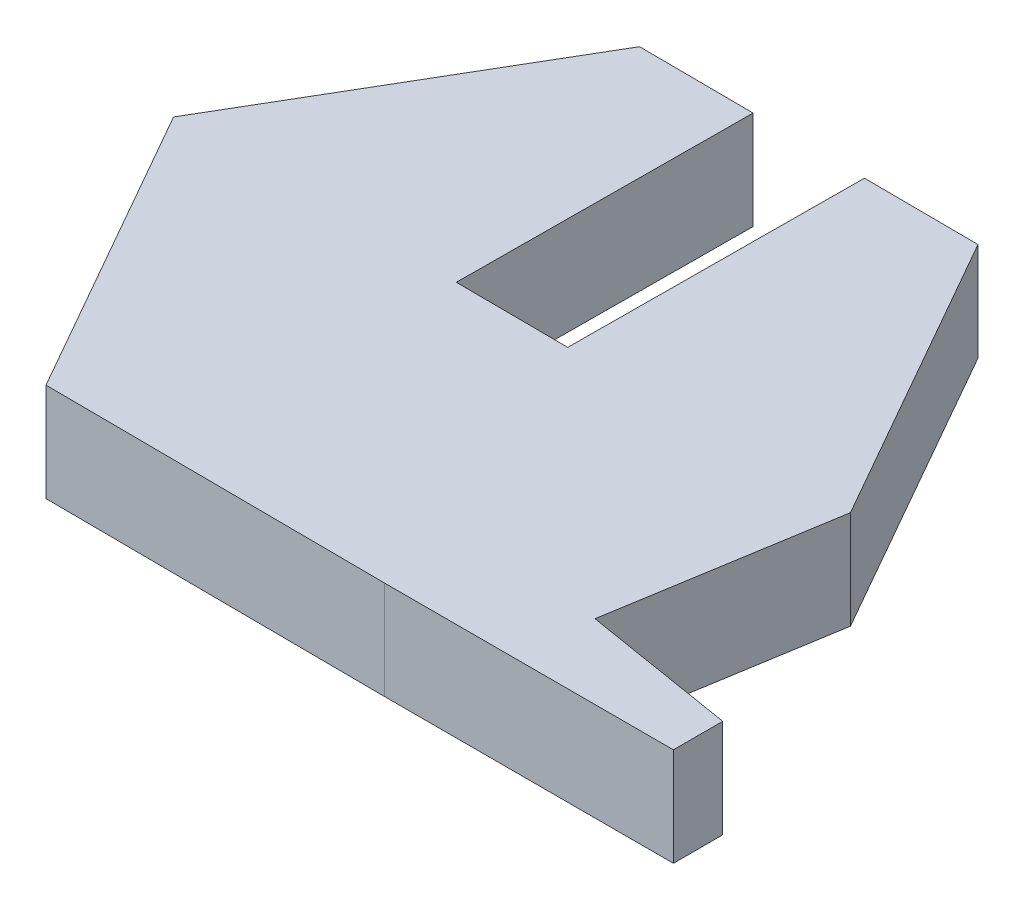
ISO-10303-21;
HEADER;
FILE_DESCRIPTION(('STEP AP214'),'2;1');
FILE_NAME('part.step','',(''),(''),'','','');
FILE_SCHEMA(('AUTOMOTIVE_DESIGN { 1 0 10303 214 1 1 1 1 }'));
ENDSEC;
DATA;
#1=APPLICATION_CONTEXT('core data for automotive mechanical design processes');
#2=APPLICATION_PROTOCOL_DEFINITION('international standard','automotive_design',2000,#1);
#3=PRODUCT_CONTEXT('',#1,'mechanical');
#4=PRODUCT('Part','Part','',(#3));
#5=PRODUCT_RELATED_PRODUCT_CATEGORY('part','',(#4));
#6=PRODUCT_DEFINITION_FORMATION('','',#4);
#7=PRODUCT_DEFINITION_CONTEXT('part definition',#1,'design');
#8=PRODUCT_DEFINITION('design','',#6,#7);
#9=PRODUCT_DEFINITION_SHAPE('','',#8);
#10=(LENGTH_UNIT() NAMED_UNIT(*) SI_UNIT(.MILLI.,.METRE.));
#11=(NAMED_UNIT(*) PLANE_ANGLE_UNIT() SI_UNIT($,.RADIAN.));
#12=(NAMED_UNIT(*) SI_UNIT($,.STERADIAN.) SOLID_ANGLE_UNIT());
#13=UNCERTAINTY_MEASURE_WITH_UNIT(LENGTH_MEASURE(1.E-05),#10,'distance_accuracy_value','');
#14=(GEOMETRIC_REPRESENTATION_CONTEXT(3) GLOBAL_UNCERTAINTY_ASSIGNED_CONTEXT((#13)) GLOBAL_UNIT_ASSIGNED_CONTEXT((#10,
#11,#12)) REPRESENTATION_CONTEXT('',''));
#15=CARTESIAN_POINT('',(0.,0.,0.));
#16=DIRECTION('',(0.,0.,1.));
#17=DIRECTION('',(1.,0.,0.));
#18=AXIS2_PLACEMENT_3D('',#15,#16,#17);
#19=CARTESIAN_POINT('',(5.43989249764885,2.5,-6.81085116172569));
#20=DIRECTION('',(-0.00625685853298923,0.,0.999980425669072));
#21=DIRECTION('',(0.999980425669072,0.,0.00625685853298923));
#22=AXIS2_PLACEMENT_3D('',#19,#20,#21);
#23=PLANE('',#22);
#24=DIRECTION('',(-0.999980425669072,0.,-0.00625685853298923));
#25=VECTOR('',#24,1.);
#26=CARTESIAN_POINT('',(5.43989249764885,0.,-6.81085116172569));
#27=LINE('',#26,#25);
#28=CARTESIAN_POINT('',(5.43989249764885,0.,-6.81085116172569));
#29=VERTEX_POINT('',#28);
#30=CARTESIAN_POINT('',(2.53494936108019,0.,-6.82902733576402));
#31=VERTEX_POINT('',#30);
#32=EDGE_CURVE('E169',#29,#31,#27,.T.);
#33=ORIENTED_EDGE('',*,*,#32,.T.);
#34=DIRECTION('',(0.,-1.,0.));
#35=VECTOR('',#34,1.);
#36=CARTESIAN_POINT('',(2.53494936108019,0.,-6.82902733576402));
#37=LINE('',#36,#35);
#38=CARTESIAN_POINT('',(2.53494936108019,2.5,-6.82902733576402));
#39=VERTEX_POINT('',#38);
#40=EDGE_CURVE('E270',#39,#31,#37,.T.);
#41=ORIENTED_EDGE('',*,*,#40,.F.);
#42=DIRECTION('',(-0.999980425669072,0.,-0.00625685853298923));
#43=VECTOR('',#42,1.);
#44=CARTESIAN_POINT('',(5.43989249764885,2.5,-6.81085116172569));
#45=LINE('',#44,#43);
#46=CARTESIAN_POINT('',(5.43989249764885,2.5,-6.81085116172569));
#47=VERTEX_POINT('',#46);
#48=EDGE_CURVE('E215',#47,#39,#45,.T.);
#49=ORIENTED_EDGE('',*,*,#48,.F.);
#50=DIRECTION('',(0.,-1.,0.));
#51=VECTOR('',#50,1.);
#52=CARTESIAN_POINT('',(5.43989249764885,2.5,-6.81085116172569));
#53=LINE('',#52,#51);
#54=EDGE_CURVE('E48',#47,#29,#53,.T.);
#55=ORIENTED_EDGE('',*,*,#54,.T.);
#56=EDGE_LOOP('',(#33,#41,#49,#55));
#57=FACE_BOUND('',#56,.T.);
#58=ADVANCED_FACE('F39',(#57),#23,.F.);
#59=CARTESIAN_POINT('',(9.7230083182344,2.5,0.716095022979621));
#60=DIRECTION('',(-0.986900559449529,0.,-0.161329742323625));
#61=DIRECTION('',(-0.161329742323625,0.,0.986900559449529));
#62=AXIS2_PLACEMENT_3D('',#59,#60,#61);
#63=PLANE('',#62);
#64=DIRECTION('',(0.161329742323625,0.,-0.986900559449529));
#65=VECTOR('',#64,1.);
#66=CARTESIAN_POINT('',(9.7230083182344,0.,0.716095022979621));
#67=LINE('',#66,#65);
#68=CARTESIAN_POINT('',(8.81032447453926,0.,6.29924530246391));
#69=VERTEX_POINT('',#68);
#70=CARTESIAN_POINT('',(9.7230083182344,0.,0.716095022979621));
#71=VERTEX_POINT('',#70);
#72=EDGE_CURVE('E160',#69,#71,#67,.T.);
#73=ORIENTED_EDGE('',*,*,#72,.T.);
#74=DIRECTION('',(0.,-1.,0.));
#75=VECTOR('',#74,1.);
#76=CARTESIAN_POINT('',(9.7230083182344,2.5,0.716095022979621));
#77=LINE('',#76,#75);
#78=CARTESIAN_POINT('',(9.7230083182344,2.5,0.716095022979621));
#79=VERTEX_POINT('',#78);
#80=EDGE_CURVE('E11',#79,#71,#77,.T.);
#81=ORIENTED_EDGE('',*,*,#80,.F.);
#82=DIRECTION('',(0.161329742323625,0.,-0.986900559449529));
#83=VECTOR('',#82,1.);
#84=CARTESIAN_POINT('',(9.7230083182344,2.5,0.716095022979621));
#85=LINE('',#84,#83);
#86=CARTESIAN_POINT('',(8.81032447453926,2.5,6.29924530246391));
#87=VERTEX_POINT('',#86);
#88=EDGE_CURVE('E189',#87,#79,#85,.T.);
#89=ORIENTED_EDGE('',*,*,#88,.F.);
#90=DIRECTION('',(0.,-1.,0.));
#91=VECTOR('',#90,1.);
#92=CARTESIAN_POINT('',(8.81032447453926,2.5,6.29924530246391));
#93=LINE('',#92,#91);
#94=EDGE_CURVE('E156',#87,#69,#93,.T.);
#95=ORIENTED_EDGE('',*,*,#94,.T.);
#96=EDGE_LOOP('',(#73,#81,#89,#95));
#97=FACE_BOUND('',#96,.T.);
#98=ADVANCED_FACE('F41',(#97),#63,.F.);
#99=CARTESIAN_POINT('',(9.7230083182344,2.5,0.716095022979621));
#100=DIRECTION('',(-0.869136881183087,0.,0.494571614397082));
#101=DIRECTION('',(0.494571614397082,0.,0.869136881183087));
#102=AXIS2_PLACEMENT_3D('',#99,#100,#101);
#103=PLANE('',#102);
#104=DIRECTION('',(-0.494571614397082,0.,-0.869136881183087));
#105=VECTOR('',#104,1.);
#106=CARTESIAN_POINT('',(9.7230083182344,0.,0.716095022979621));
#107=LINE('',#106,#105);
#108=EDGE_CURVE('E164',#71,#29,#107,.T.);
#109=ORIENTED_EDGE('',*,*,#108,.T.);
#110=ORIENTED_EDGE('',*,*,#54,.F.);
#111=DIRECTION('',(-0.494571614397082,0.,-0.869136881183087));
#112=VECTOR('',#111,1.);
#113=CARTESIAN_POINT('',(9.7230083182344,2.5,0.716095022979621));
#114=LINE('',#113,#112);
#115=EDGE_CURVE('E108',#79,#47,#114,.T.);
#116=ORIENTED_EDGE('',*,*,#115,.F.);
#117=ORIENTED_EDGE('',*,*,#80,.T.);
#118=EDGE_LOOP('',(#109,#110,#116,#117));
#119=FACE_BOUND('',#118,.T.);
#120=ADVANCED_FACE('F326',(#119),#103,.F.);
#121=CARTESIAN_POINT('',(-0.31499485207666,2.5,-6.84685938258304));
#122=VERTEX_POINT('',#121);
#123=CARTESIAN_POINT('',(-3.22019202151707,2.5,-6.86503714610023));
#124=VERTEX_POINT('',#123);
#125=EDGE_CURVE('E245',#122,#124,#45,.T.);
#126=ORIENTED_EDGE('',*,*,#125,.F.);
#127=DIRECTION('',(0.,1.,0.));
#128=VECTOR('',#127,1.);
#129=CARTESIAN_POINT('',(-0.31499485207666,0.,-6.84685938258304));
#130=LINE('',#129,#128);
#131=CARTESIAN_POINT('',(-0.31499485207666,0.,-6.84685938258304));
#132=VERTEX_POINT('',#131);
#133=EDGE_CURVE('E266',#132,#122,#130,.T.);
#134=ORIENTED_EDGE('',*,*,#133,.F.);
#135=CARTESIAN_POINT('',(-3.22019202151707,0.,-6.86503714610023));
#136=VERTEX_POINT('',#135);
#137=EDGE_CURVE('E168',#132,#136,#27,.T.);
#138=ORIENTED_EDGE('',*,*,#137,.T.);
#139=DIRECTION('',(0.,-1.,0.));
#140=VECTOR('',#139,1.);
#141=CARTESIAN_POINT('',(-3.22019202151707,2.5,-6.86503714610023));
#142=LINE('',#141,#140);
#143=EDGE_CURVE('E204',#124,#136,#142,.T.);
#144=ORIENTED_EDGE('',*,*,#143,.F.);
#145=EDGE_LOOP('',(#126,#134,#138,#144));
#146=FACE_BOUND('',#145,.T.);
#147=ADVANCED_FACE('F291',(#146),#23,.F.);
#148=CARTESIAN_POINT('',(-3.22019202151707,2.5,-6.86503714610023));
#149=DIRECTION('',(0.862880022650098,0.,0.50540881127199));
#150=DIRECTION('',(0.50540881127199,0.,-0.862880022650098));
#151=AXIS2_PLACEMENT_3D('',#148,#149,#150);
#152=PLANE('',#151);
#153=DIRECTION('',(-0.50540881127199,0.,0.862880022650098));
#154=VECTOR('',#153,1.);
#155=CARTESIAN_POINT('',(-3.22019202151707,0.,-6.86503714610023));
#156=LINE('',#155,#154);
#157=CARTESIAN_POINT('',(-7.59716072009746,0.,0.607723054230536));
#158=VERTEX_POINT('',#157);
#159=EDGE_CURVE('E173',#136,#158,#156,.T.);
#160=ORIENTED_EDGE('',*,*,#159,.T.);
#161=DIRECTION('',(0.,-1.,0.));
#162=VECTOR('',#161,1.);
#163=CARTESIAN_POINT('',(-7.59716072009746,2.5,0.607723054230536));
#164=LINE('',#163,#162);
#165=CARTESIAN_POINT('',(-7.59716072009746,2.5,0.607723054230536));
#166=VERTEX_POINT('',#165);
#167=EDGE_CURVE('E200',#166,#158,#164,.T.);
#168=ORIENTED_EDGE('',*,*,#167,.F.);
#169=DIRECTION('',(-0.50540881127199,0.,0.862880022650098));
#170=VECTOR('',#169,1.);
#171=CARTESIAN_POINT('',(-3.22019202151707,2.5,-6.86503714610023));
#172=LINE('',#171,#170);
#173=EDGE_CURVE('E248',#124,#166,#172,.T.);
#174=ORIENTED_EDGE('',*,*,#173,.F.);
#175=ORIENTED_EDGE('',*,*,#143,.T.);
#176=EDGE_LOOP('',(#160,#168,#174,#175));
#177=FACE_BOUND('',#176,.T.);
#178=ADVANCED_FACE('F298',(#177),#152,.F.);
#179=CARTESIAN_POINT('',(-7.59716072009746,2.5,0.607723054230536));
#180=DIRECTION('',(0.869136881183088,0.,-0.494571614397082));
#181=DIRECTION('',(-0.494571614397082,0.,-0.869136881183088));
#182=AXIS2_PLACEMENT_3D('',#179,#180,#181);
#183=PLANE('',#182);
#184=DIRECTION('',(0.494571614397082,0.,0.869136881183088));
#185=VECTOR('',#184,1.);
#186=CARTESIAN_POINT('',(-7.59716072009746,0.,0.607723054230536));
#187=LINE('',#186,#185);
#188=CARTESIAN_POINT('',(-3.31404489951191,0.,8.13466923893585));
#189=VERTEX_POINT('',#188);
#190=EDGE_CURVE('E176',#158,#189,#187,.T.);
#191=ORIENTED_EDGE('',*,*,#190,.T.);
#192=DIRECTION('',(0.,-1.,0.));
#193=VECTOR('',#192,1.);
#194=CARTESIAN_POINT('',(-3.31404489951191,2.5,8.13466923893585));
#195=LINE('',#194,#193);
#196=CARTESIAN_POINT('',(-3.31404489951191,2.5,8.13466923893585));
#197=VERTEX_POINT('',#196);
#198=EDGE_CURVE('E196',#197,#189,#195,.T.);
#199=ORIENTED_EDGE('',*,*,#198,.F.);
#200=DIRECTION('',(0.494571614397082,0.,0.869136881183088));
#201=VECTOR('',#200,1.);
#202=CARTESIAN_POINT('',(-7.59716072009746,2.5,0.607723054230536));
#203=LINE('',#202,#201);
#204=EDGE_CURVE('E251',#166,#197,#203,.T.);
#205=ORIENTED_EDGE('',*,*,#204,.F.);
#206=ORIENTED_EDGE('',*,*,#167,.T.);
#207=EDGE_LOOP('',(#191,#199,#205,#206));
#208=FACE_BOUND('',#207,.T.);
#209=ADVANCED_FACE('F301',(#208),#183,.F.);
#210=CARTESIAN_POINT('',(-3.31404489951191,2.5,8.13466923893585));
#211=DIRECTION('',(0.00625685853298943,0.,-0.999980425669072));
#212=DIRECTION('',(-0.999980425669072,0.,-0.00625685853298943));
#213=AXIS2_PLACEMENT_3D('',#210,#211,#212);
#214=PLANE('',#213);
#215=DIRECTION('',(0.999980425669072,0.,0.00625685853298943));
#216=VECTOR('',#215,1.);
#217=CARTESIAN_POINT('',(-3.31404489951191,0.,8.13466923893585));
#218=LINE('',#217,#216);
#219=CARTESIAN_POINT('',(5.34603961965416,0.,8.18885522331039));
#220=VERTEX_POINT('',#219);
#221=EDGE_CURVE('E179',#189,#220,#218,.T.);
#222=ORIENTED_EDGE('',*,*,#221,.T.);
#223=DIRECTION('',(0.,-1.,0.));
#224=VECTOR('',#223,1.);
#225=CARTESIAN_POINT('',(5.34603961965416,2.5,8.18885522331039));
#226=LINE('',#225,#224);
#227=CARTESIAN_POINT('',(5.34603961965416,2.5,8.18885522331039));
#228=VERTEX_POINT('',#227);
#229=EDGE_CURVE('E149',#228,#220,#226,.T.);
#230=ORIENTED_EDGE('',*,*,#229,.F.);
#231=DIRECTION('',(0.999980425669072,0.,0.00625685853298943));
#232=VECTOR('',#231,1.);
#233=CARTESIAN_POINT('',(-3.31404489951191,2.5,8.13466923893585));
#234=LINE('',#233,#232);
#235=EDGE_CURVE('E135',#197,#228,#234,.T.);
#236=ORIENTED_EDGE('',*,*,#235,.F.);
#237=ORIENTED_EDGE('',*,*,#198,.T.);
#238=EDGE_LOOP('',(#222,#230,#236,#237));
#239=FACE_BOUND('',#238,.T.);
#240=ADVANCED_FACE('F304',(#239),#214,.F.);
#241=CARTESIAN_POINT('',(12.6941052252956,2.5,8.18885522331039));
#242=DIRECTION('',(0.,0.,-1.));
#243=DIRECTION('',(-1.,0.,0.));
#244=AXIS2_PLACEMENT_3D('',#241,#242,#243);
#245=PLANE('',#244);
#246=DIRECTION('',(1.,0.,0.));
#247=VECTOR('',#246,1.);
#248=CARTESIAN_POINT('',(12.6941052252956,0.,8.18885522331039));
#249=LINE('',#248,#247);
#250=CARTESIAN_POINT('',(12.6941052252956,0.,8.18885522331039));
#251=VERTEX_POINT('',#250);
#252=EDGE_CURVE('E145',#220,#251,#249,.T.);
#253=ORIENTED_EDGE('',*,*,#252,.T.);
#254=DIRECTION('',(0.,-1.,0.));
#255=VECTOR('',#254,1.);
#256=CARTESIAN_POINT('',(12.6941052252956,2.5,8.18885522331039));
#257=LINE('',#256,#255);
#258=CARTESIAN_POINT('',(12.6941052252956,2.5,8.18885522331039));
#259=VERTEX_POINT('',#258);
#260=EDGE_CURVE('E142',#259,#251,#257,.T.);
#261=ORIENTED_EDGE('',*,*,#260,.F.);
#262=DIRECTION('',(1.,0.,0.));
#263=VECTOR('',#262,1.);
#264=CARTESIAN_POINT('',(12.6941052252956,2.5,8.18885522331039));
#265=LINE('',#264,#263);
#266=EDGE_CURVE('E127',#228,#259,#265,.T.);
#267=ORIENTED_EDGE('',*,*,#266,.F.);
#268=ORIENTED_EDGE('',*,*,#229,.T.);
#269=EDGE_LOOP('',(#253,#261,#267,#268));
#270=FACE_BOUND('',#269,.T.);
#271=ADVANCED_FACE('F143',(#270),#245,.F.);
#272=CARTESIAN_POINT('',(12.6941052252956,2.5,6.93413130162724));
#273=DIRECTION('',(-1.,0.,0.));
#274=DIRECTION('',(0.,0.,1.));
#275=AXIS2_PLACEMENT_3D('',#272,#273,#274);
#276=PLANE('',#275);
#277=DIRECTION('',(0.,0.,-1.));
#278=VECTOR('',#277,1.);
#279=CARTESIAN_POINT('',(12.6941052252956,0.,6.93413130162724));
#280=LINE('',#279,#278);
#281=CARTESIAN_POINT('',(12.6941052252956,0.,6.93413130162724));
#282=VERTEX_POINT('',#281);
#283=EDGE_CURVE('E184',#251,#282,#280,.T.);
#284=ORIENTED_EDGE('',*,*,#283,.T.);
#285=DIRECTION('',(0.,-1.,0.));
#286=VECTOR('',#285,1.);
#287=CARTESIAN_POINT('',(12.6941052252956,2.5,6.93413130162724));
#288=LINE('',#287,#286);
#289=CARTESIAN_POINT('',(12.6941052252956,2.5,6.93413130162724));
#290=VERTEX_POINT('',#289);
#291=EDGE_CURVE('E150',#290,#282,#288,.T.);
#292=ORIENTED_EDGE('',*,*,#291,.F.);
#293=DIRECTION('',(0.,0.,-1.));
#294=VECTOR('',#293,1.);
#295=CARTESIAN_POINT('',(12.6941052252956,2.5,6.93413130162724));
#296=LINE('',#295,#294);
#297=EDGE_CURVE('E132',#259,#290,#296,.T.);
#298=ORIENTED_EDGE('',*,*,#297,.F.);
#299=ORIENTED_EDGE('',*,*,#260,.T.);
#300=EDGE_LOOP('',(#284,#292,#298,#299));
#301=FACE_BOUND('',#300,.T.);
#302=ADVANCED_FACE('F152',(#301),#276,.F.);
#303=CARTESIAN_POINT('',(8.81032447453926,2.5,6.29924530246391));
#304=DIRECTION('',(-0.161329742323625,0.,0.986900559449529));
#305=DIRECTION('',(0.986900559449529,0.,0.161329742323625));
#306=AXIS2_PLACEMENT_3D('',#303,#304,#305);
#307=PLANE('',#306);
#308=DIRECTION('',(-0.986900559449529,0.,-0.161329742323625));
#309=VECTOR('',#308,1.);
#310=CARTESIAN_POINT('',(8.81032447453926,0.,6.29924530246391));
#311=LINE('',#310,#309);
#312=EDGE_CURVE('E100',#282,#69,#311,.T.);
#313=ORIENTED_EDGE('',*,*,#312,.T.);
#314=ORIENTED_EDGE('',*,*,#94,.F.);
#315=DIRECTION('',(-0.986900559449529,0.,-0.161329742323625));
#316=VECTOR('',#315,1.);
#317=CARTESIAN_POINT('',(8.81032447453926,2.5,6.29924530246391));
#318=LINE('',#317,#316);
#319=EDGE_CURVE('E64',#290,#87,#318,.T.);
#320=ORIENTED_EDGE('',*,*,#319,.F.);
#321=ORIENTED_EDGE('',*,*,#291,.T.);
#322=EDGE_LOOP('',(#313,#314,#320,#321));
#323=FACE_BOUND('',#322,.T.);
#324=ADVANCED_FACE('F305',(#323),#307,.F.);
#325=CARTESIAN_POINT('',(0.,2.5,0.));
#326=DIRECTION('',(0.,1.,0.));
#327=DIRECTION('',(0.,0.,1.));
#328=AXIS2_PLACEMENT_3D('',#325,#326,#327);
#329=PLANE('',#328);
#330=DIRECTION('',(0.00625685853298923,0.,-0.999980425669072));
#331=VECTOR('',#330,1.);
#332=CARTESIAN_POINT('',(2.48802292208277,2.5,0.670825856754015));
#333=LINE('',#332,#331);
#334=CARTESIAN_POINT('',(2.48802292208277,2.5,0.670825856754015));
#335=VERTEX_POINT('',#334);
#336=EDGE_CURVE('E165',#335,#39,#333,.T.);
#337=ORIENTED_EDGE('',*,*,#336,.F.);
#338=DIRECTION('',(0.999980425669072,0.,0.00625685853298908));
#339=VECTOR('',#338,1.);
#340=CARTESIAN_POINT('',(2.48802292208277,2.5,0.670825856754015));
#341=LINE('',#340,#339);
#342=CARTESIAN_POINT('',(-0.36192129107408,2.5,0.652993809934996));
#343=VERTEX_POINT('',#342);
#344=EDGE_CURVE('E230',#343,#335,#341,.T.);
#345=ORIENTED_EDGE('',*,*,#344,.F.);
#346=DIRECTION('',(0.00625685853298923,0.,-0.999980425669072));
#347=VECTOR('',#346,1.);
#348=CARTESIAN_POINT('',(-0.36192129107408,2.5,0.652993809934996));
#349=LINE('',#348,#347);
#350=EDGE_CURVE('E235',#343,#122,#349,.T.);
#351=ORIENTED_EDGE('',*,*,#350,.T.);
#352=ORIENTED_EDGE('',*,*,#125,.T.);
#353=ORIENTED_EDGE('',*,*,#173,.T.);
#354=ORIENTED_EDGE('',*,*,#204,.T.);
#355=ORIENTED_EDGE('',*,*,#235,.T.);
#356=ORIENTED_EDGE('',*,*,#266,.T.);
#357=ORIENTED_EDGE('',*,*,#297,.T.);
#358=ORIENTED_EDGE('',*,*,#319,.T.);
#359=ORIENTED_EDGE('',*,*,#88,.T.);
#360=ORIENTED_EDGE('',*,*,#115,.T.);
#361=ORIENTED_EDGE('',*,*,#48,.T.);
#362=EDGE_LOOP('',(#337,#345,#351,#352,#353,#354,#355,#356,#357,#358,#359,#360,#361));
#363=FACE_BOUND('',#362,.T.);
#364=ADVANCED_FACE('F130',(#363),#329,.T.);
#365=CARTESIAN_POINT('',(0.,0.,0.));
#366=DIRECTION('',(0.,1.,0.));
#367=DIRECTION('',(0.,0.,1.));
#368=AXIS2_PLACEMENT_3D('',#365,#366,#367);
#369=PLANE('',#368);
#370=DIRECTION('',(-0.999980425669072,0.,-0.00625685853298908));
#371=VECTOR('',#370,1.);
#372=CARTESIAN_POINT('',(2.48802292208277,0.,0.670825856754015));
#373=LINE('',#372,#371);
#374=CARTESIAN_POINT('',(2.48802292208277,0.,0.670825856754015));
#375=VERTEX_POINT('',#374);
#376=CARTESIAN_POINT('',(-0.36192129107408,0.,0.652993809934996));
#377=VERTEX_POINT('',#376);
#378=EDGE_CURVE('E223',#375,#377,#373,.T.);
#379=ORIENTED_EDGE('',*,*,#378,.F.);
#380=DIRECTION('',(0.00625685853298923,0.,-0.999980425669072));
#381=VECTOR('',#380,1.);
#382=CARTESIAN_POINT('',(2.48802292208277,0.,0.670825856754015));
#383=LINE('',#382,#381);
#384=EDGE_CURVE('E221',#375,#31,#383,.T.);
#385=ORIENTED_EDGE('',*,*,#384,.T.);
#386=ORIENTED_EDGE('',*,*,#32,.F.);
#387=ORIENTED_EDGE('',*,*,#108,.F.);
#388=ORIENTED_EDGE('',*,*,#72,.F.);
#389=ORIENTED_EDGE('',*,*,#312,.F.);
#390=ORIENTED_EDGE('',*,*,#283,.F.);
#391=ORIENTED_EDGE('',*,*,#252,.F.);
#392=ORIENTED_EDGE('',*,*,#221,.F.);
#393=ORIENTED_EDGE('',*,*,#190,.F.);
#394=ORIENTED_EDGE('',*,*,#159,.F.);
#395=ORIENTED_EDGE('',*,*,#137,.F.);
#396=DIRECTION('',(0.00625685853298923,0.,-0.999980425669072));
#397=VECTOR('',#396,1.);
#398=CARTESIAN_POINT('',(-0.36192129107408,0.,0.652993809934996));
#399=LINE('',#398,#397);
#400=EDGE_CURVE('E229',#377,#132,#399,.T.);
#401=ORIENTED_EDGE('',*,*,#400,.F.);
#402=EDGE_LOOP('',(#379,#385,#386,#387,#388,#389,#390,#391,#392,#393,#394,#395,#401));
#403=FACE_BOUND('',#402,.T.);
#404=ADVANCED_FACE('F219',(#403),#369,.F.);
#405=CARTESIAN_POINT('',(2.48802292208277,0.,0.670825856754015));
#406=DIRECTION('',(0.999980425669072,0.,0.00625685853298923));
#407=DIRECTION('',(0.00625685853298923,0.,-0.999980425669072));
#408=AXIS2_PLACEMENT_3D('',#405,#406,#407);
#409=PLANE('',#408);
#410=ORIENTED_EDGE('',*,*,#40,.T.);
#411=ORIENTED_EDGE('',*,*,#384,.F.);
#412=DIRECTION('',(0.,-1.,0.));
#413=VECTOR('',#412,1.);
#414=CARTESIAN_POINT('',(2.48802292208277,0.,0.670825856754015));
#415=LINE('',#414,#413);
#416=EDGE_CURVE('E55',#335,#375,#415,.T.);
#417=ORIENTED_EDGE('',*,*,#416,.F.);
#418=ORIENTED_EDGE('',*,*,#336,.T.);
#419=EDGE_LOOP('',(#410,#411,#417,#418));
#420=FACE_BOUND('',#419,.T.);
#421=ADVANCED_FACE('F309',(#420),#409,.F.);
#422=CARTESIAN_POINT('',(-0.36192129107408,0.,0.652993809934996));
#423=DIRECTION('',(-0.999980425669072,0.,-0.00625685853298923));
#424=DIRECTION('',(-0.00625685853298923,0.,0.999980425669072));
#425=AXIS2_PLACEMENT_3D('',#422,#423,#424);
#426=PLANE('',#425);
#427=ORIENTED_EDGE('',*,*,#133,.T.);
#428=ORIENTED_EDGE('',*,*,#350,.F.);
#429=DIRECTION('',(0.,1.,0.));
#430=VECTOR('',#429,1.);
#431=CARTESIAN_POINT('',(-0.36192129107408,0.,0.652993809934996));
#432=LINE('',#431,#430);
#433=EDGE_CURVE('E237',#377,#343,#432,.T.);
#434=ORIENTED_EDGE('',*,*,#433,.F.);
#435=ORIENTED_EDGE('',*,*,#400,.T.);
#436=EDGE_LOOP('',(#427,#428,#434,#435));
#437=FACE_BOUND('',#436,.T.);
#438=ADVANCED_FACE('F288',(#437),#426,.F.);
#439=CARTESIAN_POINT('',(-0.00409977851260704,0.,0.655232692343779));
#440=DIRECTION('',(-0.00625685853298908,0.,0.999980425669072));
#441=DIRECTION('',(0.999980425669072,0.,0.00625685853298908));
#442=AXIS2_PLACEMENT_3D('',#439,#440,#441);
#443=PLANE('',#442);
#444=ORIENTED_EDGE('',*,*,#416,.T.);
#445=ORIENTED_EDGE('',*,*,#378,.T.);
#446=ORIENTED_EDGE('',*,*,#433,.T.);
#447=ORIENTED_EDGE('',*,*,#344,.T.);
#448=EDGE_LOOP('',(#444,#445,#446,#447));
#449=FACE_BOUND('',#448,.T.);
#450=ADVANCED_FACE('F280',(#449),#443,.F.);
#451=CLOSED_SHELL('',(#58,#98,#120,#147,#178,#209,#240,#271,#302,#324,#364,#404,#421,#438,#450));
#452=MANIFOLD_SOLID_BREP('B2',#451);
#453=ADVANCED_BREP_SHAPE_REPRESENTATION('',(#18,#452),#14);
#454=SHAPE_DEFINITION_REPRESENTATION(#9,#453);
ENDSEC;
END-ISO-10303-21;
